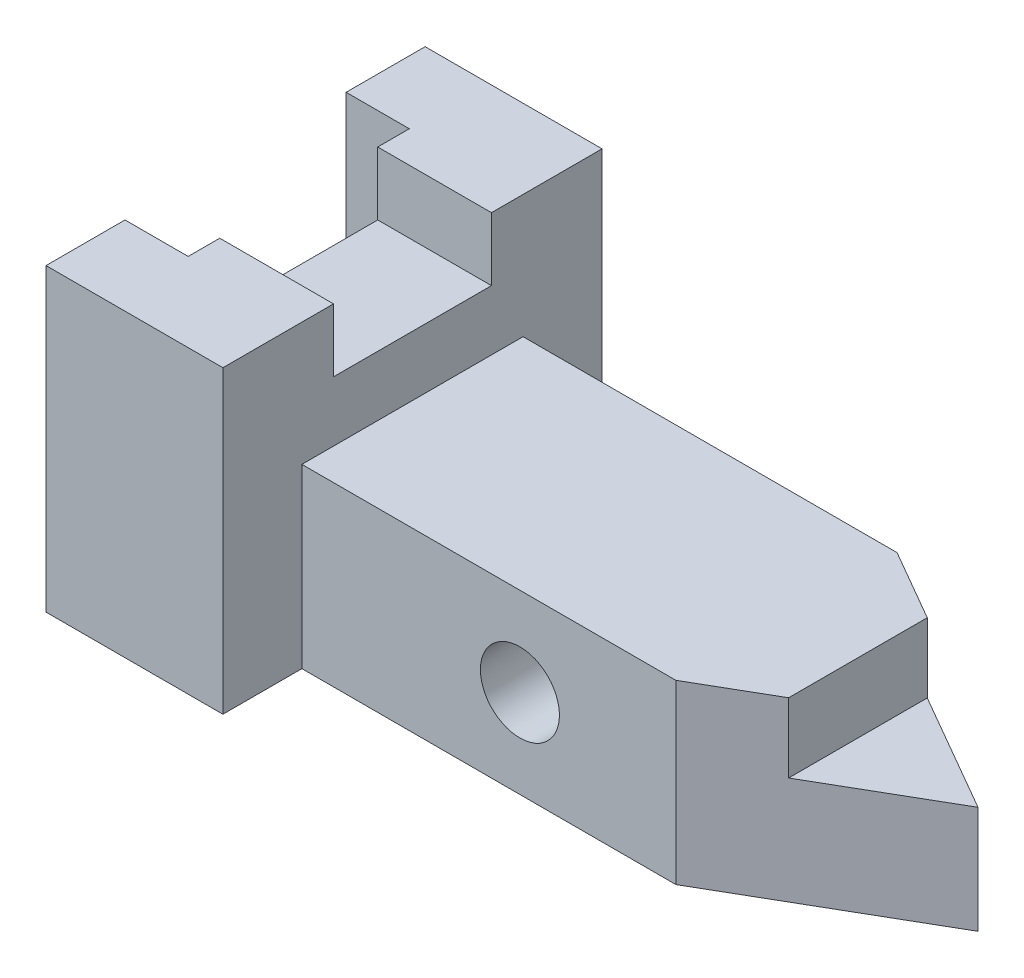
ISO-10303-21;
HEADER;
FILE_DESCRIPTION(('STEP AP214'),'2;1');
FILE_NAME('part.step','',(''),(''),'','','');
FILE_SCHEMA(('AUTOMOTIVE_DESIGN { 1 0 10303 214 1 1 1 1 }'));
ENDSEC;
DATA;
#1=APPLICATION_CONTEXT('core data for automotive mechanical design processes');
#2=APPLICATION_PROTOCOL_DEFINITION('international standard','automotive_design',2000,#1);
#3=PRODUCT_CONTEXT('',#1,'mechanical');
#4=PRODUCT('Part','Part','',(#3));
#5=PRODUCT_RELATED_PRODUCT_CATEGORY('part','',(#4));
#6=PRODUCT_DEFINITION_FORMATION('','',#4);
#7=PRODUCT_DEFINITION_CONTEXT('part definition',#1,'design');
#8=PRODUCT_DEFINITION('design','',#6,#7);
#9=PRODUCT_DEFINITION_SHAPE('','',#8);
#10=(LENGTH_UNIT() NAMED_UNIT(*) SI_UNIT(.MILLI.,.METRE.));
#11=(NAMED_UNIT(*) PLANE_ANGLE_UNIT() SI_UNIT($,.RADIAN.));
#12=(NAMED_UNIT(*) SI_UNIT($,.STERADIAN.) SOLID_ANGLE_UNIT());
#13=UNCERTAINTY_MEASURE_WITH_UNIT(LENGTH_MEASURE(1.E-05),#10,'distance_accuracy_value','');
#14=(GEOMETRIC_REPRESENTATION_CONTEXT(3) GLOBAL_UNCERTAINTY_ASSIGNED_CONTEXT((#13)) GLOBAL_UNIT_ASSIGNED_CONTEXT((#10,
#11,#12)) REPRESENTATION_CONTEXT('',''));
#15=CARTESIAN_POINT('',(0.,0.,0.));
#16=DIRECTION('',(0.,0.,1.));
#17=DIRECTION('',(1.,0.,0.));
#18=AXIS2_PLACEMENT_3D('',#15,#16,#17);
#19=CARTESIAN_POINT('',(78.4241366414252,28.448,17.78));
#20=DIRECTION('',(0.,0.,-1.));
#21=DIRECTION('',(-1.,0.,0.));
#22=AXIS2_PLACEMENT_3D('',#19,#20,#21);
#23=PLANE('',#22);
#24=DIRECTION('',(1.,0.,0.));
#25=VECTOR('',#24,1.);
#26=CARTESIAN_POINT('',(78.4241366414252,0.,17.78));
#27=LINE('',#26,#25);
#28=CARTESIAN_POINT('',(18.288,0.,17.78));
#29=VERTEX_POINT('',#28);
#30=CARTESIAN_POINT('',(78.4241366414252,0.,17.78));
#31=VERTEX_POINT('',#30);
#32=EDGE_CURVE('E350',#29,#31,#27,.T.);
#33=ORIENTED_EDGE('',*,*,#32,.T.);
#34=DIRECTION('',(0.,-1.,0.));
#35=VECTOR('',#34,1.);
#36=CARTESIAN_POINT('',(78.4241366414252,28.448,17.78));
#37=LINE('',#36,#35);
#38=CARTESIAN_POINT('',(78.4241366414252,28.448,17.78));
#39=VERTEX_POINT('',#38);
#40=EDGE_CURVE('E202',#39,#31,#37,.T.);
#41=ORIENTED_EDGE('',*,*,#40,.F.);
#42=DIRECTION('',(1.,0.,0.));
#43=VECTOR('',#42,1.);
#44=CARTESIAN_POINT('',(78.4241366414252,28.448,17.78));
#45=LINE('',#44,#43);
#46=CARTESIAN_POINT('',(18.288,28.448,17.78));
#47=VERTEX_POINT('',#46);
#48=EDGE_CURVE('E337',#47,#39,#45,.T.);
#49=ORIENTED_EDGE('',*,*,#48,.F.);
#50=DIRECTION('',(0.,-1.,0.));
#51=VECTOR('',#50,1.);
#52=CARTESIAN_POINT('',(18.288,28.448,17.78));
#53=LINE('',#52,#51);
#54=EDGE_CURVE('E346',#47,#29,#53,.T.);
#55=ORIENTED_EDGE('',*,*,#54,.T.);
#56=EDGE_LOOP('',(#33,#41,#49,#55));
#57=FACE_BOUND('',#56,.T.);
#58=CARTESIAN_POINT('',(53.34,14.224,17.78));
#59=DIRECTION('',(0.,0.,-1.));
#60=DIRECTION('',(-1.,0.,0.));
#61=AXIS2_PLACEMENT_3D('',#58,#59,#60);
#62=CIRCLE('',#61,6.35);
#63=CARTESIAN_POINT('',(46.99,14.224,17.78));
#64=VERTEX_POINT('',#63);
#65=EDGE_CURVE('E378',#64,#64,#62,.T.);
#66=ORIENTED_EDGE('',*,*,#65,.T.);
#67=EDGE_LOOP('',(#66));
#68=FACE_BOUND('',#67,.T.);
#69=ADVANCED_FACE('F46',(#57,#68),#23,.F.);
#70=CARTESIAN_POINT('',(18.288,28.448,-17.78));
#71=DIRECTION('',(0.,0.,1.));
#72=DIRECTION('',(1.,0.,0.));
#73=AXIS2_PLACEMENT_3D('',#70,#71,#72);
#74=PLANE('',#73);
#75=DIRECTION('',(-1.,0.,0.));
#76=VECTOR('',#75,1.);
#77=CARTESIAN_POINT('',(18.288,0.,-17.78));
#78=LINE('',#77,#76);
#79=CARTESIAN_POINT('',(78.4241366414252,0.,-17.78));
#80=VERTEX_POINT('',#79);
#81=CARTESIAN_POINT('',(18.288,0.,-17.78));
#82=VERTEX_POINT('',#81);
#83=EDGE_CURVE('E71',#80,#82,#78,.T.);
#84=ORIENTED_EDGE('',*,*,#83,.T.);
#85=DIRECTION('',(0.,-1.,0.));
#86=VECTOR('',#85,1.);
#87=CARTESIAN_POINT('',(18.288,28.448,-17.78));
#88=LINE('',#87,#86);
#89=CARTESIAN_POINT('',(18.288,28.448,-17.78));
#90=VERTEX_POINT('',#89);
#91=EDGE_CURVE('E207',#90,#82,#88,.T.);
#92=ORIENTED_EDGE('',*,*,#91,.F.);
#93=DIRECTION('',(-1.,0.,0.));
#94=VECTOR('',#93,1.);
#95=CARTESIAN_POINT('',(18.288,28.448,-17.78));
#96=LINE('',#95,#94);
#97=CARTESIAN_POINT('',(78.4241366414252,28.448,-17.78));
#98=VERTEX_POINT('',#97);
#99=EDGE_CURVE('E366',#98,#90,#96,.T.);
#100=ORIENTED_EDGE('',*,*,#99,.F.);
#101=DIRECTION('',(0.,-1.,0.));
#102=VECTOR('',#101,1.);
#103=CARTESIAN_POINT('',(78.4241366414252,28.448,-17.78));
#104=LINE('',#103,#102);
#105=EDGE_CURVE('E203',#98,#80,#104,.T.);
#106=ORIENTED_EDGE('',*,*,#105,.T.);
#107=EDGE_LOOP('',(#84,#92,#100,#106));
#108=FACE_BOUND('',#107,.T.);
#109=CARTESIAN_POINT('',(53.34,14.224,-17.78));
#110=DIRECTION('',(0.,0.,1.));
#111=DIRECTION('',(1.,0.,0.));
#112=AXIS2_PLACEMENT_3D('',#109,#110,#111);
#113=CIRCLE('',#112,6.35);
#114=CARTESIAN_POINT('',(59.69,14.224,-17.78));
#115=VERTEX_POINT('',#114);
#116=EDGE_CURVE('E385',#115,#115,#113,.F.);
#117=ORIENTED_EDGE('',*,*,#116,.F.);
#118=EDGE_LOOP('',(#117));
#119=FACE_BOUND('',#118,.T.);
#120=ADVANCED_FACE('F379',(#108,#119),#74,.F.);
#121=CARTESIAN_POINT('',(18.288,48.26,30.48));
#122=DIRECTION('',(-1.,0.,0.));
#123=DIRECTION('',(0.,0.,1.));
#124=AXIS2_PLACEMENT_3D('',#121,#122,#123);
#125=PLANE('',#124);
#126=ORIENTED_EDGE('',*,*,#54,.F.);
#127=DIRECTION('',(0.,0.,1.));
#128=VECTOR('',#127,1.);
#129=CARTESIAN_POINT('',(18.288,28.448,17.78));
#130=LINE('',#129,#128);
#131=EDGE_CURVE('E348',#90,#47,#130,.T.);
#132=ORIENTED_EDGE('',*,*,#131,.F.);
#133=ORIENTED_EDGE('',*,*,#91,.T.);
#134=DIRECTION('',(0.,0.,-1.));
#135=VECTOR('',#134,1.);
#136=CARTESIAN_POINT('',(18.288,0.,30.48));
#137=LINE('',#136,#135);
#138=CARTESIAN_POINT('',(18.288,0.,-30.48));
#139=VERTEX_POINT('',#138);
#140=EDGE_CURVE('E256',#82,#139,#137,.T.);
#141=ORIENTED_EDGE('',*,*,#140,.T.);
#142=DIRECTION('',(0.,-1.,0.));
#143=VECTOR('',#142,1.);
#144=CARTESIAN_POINT('',(18.288,48.26,-30.48));
#145=LINE('',#144,#143);
#146=CARTESIAN_POINT('',(18.288,48.26,-30.48));
#147=VERTEX_POINT('',#146);
#148=EDGE_CURVE('E279',#147,#139,#145,.T.);
#149=ORIENTED_EDGE('',*,*,#148,.F.);
#150=DIRECTION('',(0.,0.,-1.));
#151=VECTOR('',#150,1.);
#152=CARTESIAN_POINT('',(18.288,48.26,30.48));
#153=LINE('',#152,#151);
#154=CARTESIAN_POINT('',(18.288,48.26,-12.7));
#155=VERTEX_POINT('',#154);
#156=EDGE_CURVE('E235',#155,#147,#153,.T.);
#157=ORIENTED_EDGE('',*,*,#156,.F.);
#158=DIRECTION('',(0.,1.,0.));
#159=VECTOR('',#158,1.);
#160=CARTESIAN_POINT('',(18.288,48.26,-12.7));
#161=LINE('',#160,#159);
#162=CARTESIAN_POINT('',(18.288,38.1,-12.7));
#163=VERTEX_POINT('',#162);
#164=EDGE_CURVE('E216',#163,#155,#161,.T.);
#165=ORIENTED_EDGE('',*,*,#164,.F.);
#166=DIRECTION('',(0.,0.,-1.));
#167=VECTOR('',#166,1.);
#168=CARTESIAN_POINT('',(18.288,38.1,12.7));
#169=LINE('',#168,#167);
#170=CARTESIAN_POINT('',(18.288,38.1,12.7));
#171=VERTEX_POINT('',#170);
#172=EDGE_CURVE('E213',#171,#163,#169,.T.);
#173=ORIENTED_EDGE('',*,*,#172,.F.);
#174=DIRECTION('',(0.,-1.,0.));
#175=VECTOR('',#174,1.);
#176=CARTESIAN_POINT('',(18.288,48.26,12.7));
#177=LINE('',#176,#175);
#178=CARTESIAN_POINT('',(18.288,48.26,12.7));
#179=VERTEX_POINT('',#178);
#180=EDGE_CURVE('E205',#179,#171,#177,.T.);
#181=ORIENTED_EDGE('',*,*,#180,.F.);
#182=CARTESIAN_POINT('',(18.288,48.26,30.48));
#183=VERTEX_POINT('',#182);
#184=EDGE_CURVE('E236',#183,#179,#153,.T.);
#185=ORIENTED_EDGE('',*,*,#184,.F.);
#186=DIRECTION('',(0.,-1.,0.));
#187=VECTOR('',#186,1.);
#188=CARTESIAN_POINT('',(18.288,48.26,30.48));
#189=LINE('',#188,#187);
#190=CARTESIAN_POINT('',(18.288,0.,30.48));
#191=VERTEX_POINT('',#190);
#192=EDGE_CURVE('E276',#183,#191,#189,.T.);
#193=ORIENTED_EDGE('',*,*,#192,.T.);
#194=EDGE_CURVE('E265',#191,#29,#137,.T.);
#195=ORIENTED_EDGE('',*,*,#194,.T.);
#196=EDGE_LOOP('',(#126,#132,#133,#141,#149,#157,#165,#173,#181,#185,#193,#195));
#197=FACE_BOUND('',#196,.T.);
#198=ADVANCED_FACE('F334',(#197),#125,.F.);
#199=CARTESIAN_POINT('',(-10.16,48.26,17.78));
#200=DIRECTION('',(0.,-1.,0.));
#201=DIRECTION('',(0.,0.,-1.));
#202=AXIS2_PLACEMENT_3D('',#199,#200,#201);
#203=PLANE('',#202);
#204=ORIENTED_EDGE('',*,*,#184,.T.);
#205=DIRECTION('',(-1.,0.,0.));
#206=VECTOR('',#205,1.);
#207=CARTESIAN_POINT('',(-10.16,48.26,12.7));
#208=LINE('',#207,#206);
#209=CARTESIAN_POINT('',(0.,48.26,12.7));
#210=VERTEX_POINT('',#209);
#211=EDGE_CURVE('E55',#179,#210,#208,.T.);
#212=ORIENTED_EDGE('',*,*,#211,.T.);
#213=DIRECTION('',(0.,0.,1.));
#214=VECTOR('',#213,1.);
#215=CARTESIAN_POINT('',(0.,48.26,17.78));
#216=LINE('',#215,#214);
#217=CARTESIAN_POINT('',(0.,48.26,17.78));
#218=VERTEX_POINT('',#217);
#219=EDGE_CURVE('E245',#210,#218,#216,.T.);
#220=ORIENTED_EDGE('',*,*,#219,.T.);
#221=DIRECTION('',(-1.,0.,0.));
#222=VECTOR('',#221,1.);
#223=CARTESIAN_POINT('',(-10.16,48.26,17.78));
#224=LINE('',#223,#222);
#225=CARTESIAN_POINT('',(-10.16,48.26,17.78));
#226=VERTEX_POINT('',#225);
#227=EDGE_CURVE('E249',#218,#226,#224,.T.);
#228=ORIENTED_EDGE('',*,*,#227,.T.);
#229=DIRECTION('',(0.,0.,1.));
#230=VECTOR('',#229,1.);
#231=CARTESIAN_POINT('',(-10.16,48.26,30.48));
#232=LINE('',#231,#230);
#233=CARTESIAN_POINT('',(-10.16,48.26,30.48));
#234=VERTEX_POINT('',#233);
#235=EDGE_CURVE('E229',#226,#234,#232,.T.);
#236=ORIENTED_EDGE('',*,*,#235,.T.);
#237=DIRECTION('',(1.,0.,0.));
#238=VECTOR('',#237,1.);
#239=CARTESIAN_POINT('',(-10.16,48.26,30.48));
#240=LINE('',#239,#238);
#241=EDGE_CURVE('E232',#234,#183,#240,.T.);
#242=ORIENTED_EDGE('',*,*,#241,.T.);
#243=EDGE_LOOP('',(#204,#212,#220,#228,#236,#242));
#244=FACE_BOUND('',#243,.T.);
#245=ADVANCED_FACE('F422',(#244),#203,.F.);
#246=CARTESIAN_POINT('',(-10.16,48.26,30.48));
#247=DIRECTION('',(1.,0.,0.));
#248=DIRECTION('',(0.,0.,-1.));
#249=AXIS2_PLACEMENT_3D('',#246,#247,#248);
#250=PLANE('',#249);
#251=DIRECTION('',(0.,0.,1.));
#252=VECTOR('',#251,1.);
#253=CARTESIAN_POINT('',(-10.16,0.,30.48));
#254=LINE('',#253,#252);
#255=CARTESIAN_POINT('',(-10.16,0.,17.78));
#256=VERTEX_POINT('',#255);
#257=CARTESIAN_POINT('',(-10.16,0.,30.48));
#258=VERTEX_POINT('',#257);
#259=EDGE_CURVE('E228',#256,#258,#254,.T.);
#260=ORIENTED_EDGE('',*,*,#259,.T.);
#261=DIRECTION('',(0.,-1.,0.));
#262=VECTOR('',#261,1.);
#263=CARTESIAN_POINT('',(-10.16,48.26,30.48));
#264=LINE('',#263,#262);
#265=EDGE_CURVE('E273',#234,#258,#264,.T.);
#266=ORIENTED_EDGE('',*,*,#265,.F.);
#267=ORIENTED_EDGE('',*,*,#235,.F.);
#268=DIRECTION('',(0.,-1.,0.));
#269=VECTOR('',#268,1.);
#270=CARTESIAN_POINT('',(-10.16,48.26,17.78));
#271=LINE('',#270,#269);
#272=EDGE_CURVE('E251',#226,#256,#271,.T.);
#273=ORIENTED_EDGE('',*,*,#272,.T.);
#274=EDGE_LOOP('',(#260,#266,#267,#273));
#275=FACE_BOUND('',#274,.T.);
#276=ADVANCED_FACE('F48',(#275),#250,.F.);
#277=CARTESIAN_POINT('',(-10.16,48.26,30.48));
#278=DIRECTION('',(0.,0.,-1.));
#279=DIRECTION('',(-1.,0.,0.));
#280=AXIS2_PLACEMENT_3D('',#277,#278,#279);
#281=PLANE('',#280);
#282=DIRECTION('',(1.,0.,0.));
#283=VECTOR('',#282,1.);
#284=CARTESIAN_POINT('',(-10.16,0.,30.48));
#285=LINE('',#284,#283);
#286=EDGE_CURVE('E254',#258,#191,#285,.T.);
#287=ORIENTED_EDGE('',*,*,#286,.T.);
#288=ORIENTED_EDGE('',*,*,#192,.F.);
#289=ORIENTED_EDGE('',*,*,#241,.F.);
#290=ORIENTED_EDGE('',*,*,#265,.T.);
#291=EDGE_LOOP('',(#287,#288,#289,#290));
#292=FACE_BOUND('',#291,.T.);
#293=ADVANCED_FACE('F436',(#292),#281,.F.);
#294=CARTESIAN_POINT('',(-10.16,48.26,-30.48));
#295=DIRECTION('',(0.,0.,1.));
#296=DIRECTION('',(1.,0.,0.));
#297=AXIS2_PLACEMENT_3D('',#294,#295,#296);
#298=PLANE('',#297);
#299=DIRECTION('',(-1.,0.,0.));
#300=VECTOR('',#299,1.);
#301=CARTESIAN_POINT('',(-10.16,0.,-30.48));
#302=LINE('',#301,#300);
#303=CARTESIAN_POINT('',(-10.16,0.,-30.48));
#304=VERTEX_POINT('',#303);
#305=EDGE_CURVE('E259',#139,#304,#302,.T.);
#306=ORIENTED_EDGE('',*,*,#305,.T.);
#307=DIRECTION('',(0.,-1.,0.));
#308=VECTOR('',#307,1.);
#309=CARTESIAN_POINT('',(-10.16,48.26,-30.48));
#310=LINE('',#309,#308);
#311=CARTESIAN_POINT('',(-10.16,48.26,-30.48));
#312=VERTEX_POINT('',#311);
#313=EDGE_CURVE('E282',#312,#304,#310,.T.);
#314=ORIENTED_EDGE('',*,*,#313,.F.);
#315=DIRECTION('',(-1.,0.,0.));
#316=VECTOR('',#315,1.);
#317=CARTESIAN_POINT('',(-10.16,48.26,-30.48));
#318=LINE('',#317,#316);
#319=EDGE_CURVE('E239',#147,#312,#318,.T.);
#320=ORIENTED_EDGE('',*,*,#319,.F.);
#321=ORIENTED_EDGE('',*,*,#148,.T.);
#322=EDGE_LOOP('',(#306,#314,#320,#321));
#323=FACE_BOUND('',#322,.T.);
#324=ADVANCED_FACE('F307',(#323),#298,.F.);
#325=CARTESIAN_POINT('',(-10.16,48.26,-17.78));
#326=DIRECTION('',(1.,0.,0.));
#327=DIRECTION('',(0.,0.,-1.));
#328=AXIS2_PLACEMENT_3D('',#325,#326,#327);
#329=PLANE('',#328);
#330=DIRECTION('',(0.,0.,1.));
#331=VECTOR('',#330,1.);
#332=CARTESIAN_POINT('',(-10.16,0.,-17.78));
#333=LINE('',#332,#331);
#334=CARTESIAN_POINT('',(-10.16,0.,-17.78));
#335=VERTEX_POINT('',#334);
#336=EDGE_CURVE('E300',#304,#335,#333,.T.);
#337=ORIENTED_EDGE('',*,*,#336,.T.);
#338=DIRECTION('',(0.,-1.,0.));
#339=VECTOR('',#338,1.);
#340=CARTESIAN_POINT('',(-10.16,48.26,-17.78));
#341=LINE('',#340,#339);
#342=CARTESIAN_POINT('',(-10.16,48.26,-17.78));
#343=VERTEX_POINT('',#342);
#344=EDGE_CURVE('E285',#343,#335,#341,.T.);
#345=ORIENTED_EDGE('',*,*,#344,.F.);
#346=DIRECTION('',(0.,0.,1.));
#347=VECTOR('',#346,1.);
#348=CARTESIAN_POINT('',(-10.16,48.26,-17.78));
#349=LINE('',#348,#347);
#350=EDGE_CURVE('E241',#312,#343,#349,.T.);
#351=ORIENTED_EDGE('',*,*,#350,.F.);
#352=ORIENTED_EDGE('',*,*,#313,.T.);
#353=EDGE_LOOP('',(#337,#345,#351,#352));
#354=FACE_BOUND('',#353,.T.);
#355=ADVANCED_FACE('F313',(#354),#329,.F.);
#356=CARTESIAN_POINT('',(0.,48.26,-17.78));
#357=DIRECTION('',(0.,0.,-1.));
#358=DIRECTION('',(-1.,0.,0.));
#359=AXIS2_PLACEMENT_3D('',#356,#357,#358);
#360=PLANE('',#359);
#361=DIRECTION('',(1.,0.,0.));
#362=VECTOR('',#361,1.);
#363=CARTESIAN_POINT('',(0.,0.,-17.78));
#364=LINE('',#363,#362);
#365=CARTESIAN_POINT('',(0.,0.,-17.78));
#366=VERTEX_POINT('',#365);
#367=EDGE_CURVE('E299',#335,#366,#364,.T.);
#368=ORIENTED_EDGE('',*,*,#367,.T.);
#369=DIRECTION('',(0.,-1.,0.));
#370=VECTOR('',#369,1.);
#371=CARTESIAN_POINT('',(0.,48.26,-17.78));
#372=LINE('',#371,#370);
#373=CARTESIAN_POINT('',(0.,48.26,-17.78));
#374=VERTEX_POINT('',#373);
#375=EDGE_CURVE('E288',#374,#366,#372,.T.);
#376=ORIENTED_EDGE('',*,*,#375,.F.);
#377=DIRECTION('',(1.,0.,0.));
#378=VECTOR('',#377,1.);
#379=CARTESIAN_POINT('',(0.,48.26,-17.78));
#380=LINE('',#379,#378);
#381=EDGE_CURVE('E243',#343,#374,#380,.T.);
#382=ORIENTED_EDGE('',*,*,#381,.F.);
#383=ORIENTED_EDGE('',*,*,#344,.T.);
#384=EDGE_LOOP('',(#368,#376,#382,#383));
#385=FACE_BOUND('',#384,.T.);
#386=ADVANCED_FACE('F321',(#385),#360,.F.);
#387=CARTESIAN_POINT('',(0.,48.26,17.78));
#388=DIRECTION('',(1.,0.,0.));
#389=DIRECTION('',(0.,0.,-1.));
#390=AXIS2_PLACEMENT_3D('',#387,#388,#389);
#391=PLANE('',#390);
#392=ORIENTED_EDGE('',*,*,#219,.F.);
#393=DIRECTION('',(0.,-1.,0.));
#394=VECTOR('',#393,1.);
#395=CARTESIAN_POINT('',(0.,48.26,12.7));
#396=LINE('',#395,#394);
#397=CARTESIAN_POINT('',(0.,38.1,12.7));
#398=VERTEX_POINT('',#397);
#399=EDGE_CURVE('E225',#210,#398,#396,.T.);
#400=ORIENTED_EDGE('',*,*,#399,.T.);
#401=DIRECTION('',(0.,0.,-1.));
#402=VECTOR('',#401,1.);
#403=CARTESIAN_POINT('',(0.,38.1,17.78));
#404=LINE('',#403,#402);
#405=CARTESIAN_POINT('',(0.,38.1,-12.7));
#406=VERTEX_POINT('',#405);
#407=EDGE_CURVE('E13',#398,#406,#404,.T.);
#408=ORIENTED_EDGE('',*,*,#407,.T.);
#409=DIRECTION('',(0.,1.,0.));
#410=VECTOR('',#409,1.);
#411=CARTESIAN_POINT('',(0.,48.26,-12.7));
#412=LINE('',#411,#410);
#413=CARTESIAN_POINT('',(0.,48.26,-12.7));
#414=VERTEX_POINT('',#413);
#415=EDGE_CURVE('E221',#406,#414,#412,.T.);
#416=ORIENTED_EDGE('',*,*,#415,.T.);
#417=EDGE_CURVE('E246',#374,#414,#216,.T.);
#418=ORIENTED_EDGE('',*,*,#417,.F.);
#419=ORIENTED_EDGE('',*,*,#375,.T.);
#420=DIRECTION('',(0.,0.,1.));
#421=VECTOR('',#420,1.);
#422=CARTESIAN_POINT('',(0.,0.,17.78));
#423=LINE('',#422,#421);
#424=CARTESIAN_POINT('',(0.,0.,17.78));
#425=VERTEX_POINT('',#424);
#426=EDGE_CURVE('E297',#366,#425,#423,.T.);
#427=ORIENTED_EDGE('',*,*,#426,.T.);
#428=DIRECTION('',(0.,-1.,0.));
#429=VECTOR('',#428,1.);
#430=CARTESIAN_POINT('',(0.,48.26,17.78));
#431=LINE('',#430,#429);
#432=EDGE_CURVE('E291',#218,#425,#431,.T.);
#433=ORIENTED_EDGE('',*,*,#432,.F.);
#434=EDGE_LOOP('',(#392,#400,#408,#416,#418,#419,#427,#433));
#435=FACE_BOUND('',#434,.T.);
#436=ADVANCED_FACE('F326',(#435),#391,.F.);
#437=CARTESIAN_POINT('',(-10.16,48.26,17.78));
#438=DIRECTION('',(0.,0.,1.));
#439=DIRECTION('',(1.,0.,0.));
#440=AXIS2_PLACEMENT_3D('',#437,#438,#439);
#441=PLANE('',#440);
#442=DIRECTION('',(-1.,0.,0.));
#443=VECTOR('',#442,1.);
#444=CARTESIAN_POINT('',(-10.16,0.,17.78));
#445=LINE('',#444,#443);
#446=EDGE_CURVE('E233',#425,#256,#445,.T.);
#447=ORIENTED_EDGE('',*,*,#446,.T.);
#448=ORIENTED_EDGE('',*,*,#272,.F.);
#449=ORIENTED_EDGE('',*,*,#227,.F.);
#450=ORIENTED_EDGE('',*,*,#432,.T.);
#451=EDGE_LOOP('',(#447,#448,#449,#450));
#452=FACE_BOUND('',#451,.T.);
#453=ADVANCED_FACE('F421',(#452),#441,.F.);
#454=ORIENTED_EDGE('',*,*,#417,.T.);
#455=DIRECTION('',(1.,0.,0.));
#456=VECTOR('',#455,1.);
#457=CARTESIAN_POINT('',(-10.16,48.26,-12.7));
#458=LINE('',#457,#456);
#459=EDGE_CURVE('E270',#414,#155,#458,.T.);
#460=ORIENTED_EDGE('',*,*,#459,.T.);
#461=ORIENTED_EDGE('',*,*,#156,.T.);
#462=ORIENTED_EDGE('',*,*,#319,.T.);
#463=ORIENTED_EDGE('',*,*,#350,.T.);
#464=ORIENTED_EDGE('',*,*,#381,.T.);
#465=EDGE_LOOP('',(#454,#460,#461,#462,#463,#464));
#466=FACE_BOUND('',#465,.T.);
#467=ADVANCED_FACE('F329',(#466),#203,.F.);
#468=CARTESIAN_POINT('',(-10.16,0.,17.78));
#469=DIRECTION('',(0.,-1.,0.));
#470=DIRECTION('',(0.,0.,-1.));
#471=AXIS2_PLACEMENT_3D('',#468,#469,#470);
#472=PLANE('',#471);
#473=ORIENTED_EDGE('',*,*,#259,.F.);
#474=ORIENTED_EDGE('',*,*,#446,.F.);
#475=ORIENTED_EDGE('',*,*,#426,.F.);
#476=ORIENTED_EDGE('',*,*,#367,.F.);
#477=ORIENTED_EDGE('',*,*,#336,.F.);
#478=ORIENTED_EDGE('',*,*,#305,.F.);
#479=ORIENTED_EDGE('',*,*,#140,.F.);
#480=ORIENTED_EDGE('',*,*,#83,.F.);
#481=DIRECTION('',(-0.86602540378444,0.,-0.499999999999998));
#482=VECTOR('',#481,1.);
#483=CARTESIAN_POINT('',(78.4241366414252,0.,-17.78));
#484=LINE('',#483,#482);
#485=CARTESIAN_POINT('',(109.22,0.,0.));
#486=VERTEX_POINT('',#485);
#487=EDGE_CURVE('E336',#486,#80,#484,.T.);
#488=ORIENTED_EDGE('',*,*,#487,.F.);
#489=DIRECTION('',(0.86602540378444,0.,-0.499999999999998));
#490=VECTOR('',#489,1.);
#491=CARTESIAN_POINT('',(109.22,0.,0.));
#492=LINE('',#491,#490);
#493=EDGE_CURVE('E200',#31,#486,#492,.T.);
#494=ORIENTED_EDGE('',*,*,#493,.F.);
#495=ORIENTED_EDGE('',*,*,#32,.F.);
#496=ORIENTED_EDGE('',*,*,#194,.F.);
#497=ORIENTED_EDGE('',*,*,#286,.F.);
#498=EDGE_LOOP('',(#473,#474,#475,#476,#477,#478,#479,#480,#488,#494,#495,#496,#497));
#499=FACE_BOUND('',#498,.T.);
#500=ADVANCED_FACE('F316',(#499),#472,.T.);
#501=CARTESIAN_POINT('',(-10.16,38.1,12.7));
#502=DIRECTION('',(0.,-1.,0.));
#503=DIRECTION('',(0.,0.,-1.));
#504=AXIS2_PLACEMENT_3D('',#501,#502,#503);
#505=PLANE('',#504);
#506=DIRECTION('',(1.,0.,0.));
#507=VECTOR('',#506,1.);
#508=CARTESIAN_POINT('',(-10.16,38.1,12.7));
#509=LINE('',#508,#507);
#510=EDGE_CURVE('E218',#398,#171,#509,.T.);
#511=ORIENTED_EDGE('',*,*,#510,.T.);
#512=ORIENTED_EDGE('',*,*,#172,.T.);
#513=DIRECTION('',(1.,0.,0.));
#514=VECTOR('',#513,1.);
#515=CARTESIAN_POINT('',(-10.16,38.1,-12.7));
#516=LINE('',#515,#514);
#517=EDGE_CURVE('E219',#406,#163,#516,.T.);
#518=ORIENTED_EDGE('',*,*,#517,.F.);
#519=ORIENTED_EDGE('',*,*,#407,.F.);
#520=EDGE_LOOP('',(#511,#512,#518,#519));
#521=FACE_BOUND('',#520,.T.);
#522=ADVANCED_FACE('F412',(#521),#505,.F.);
#523=CARTESIAN_POINT('',(-10.16,48.26,12.7));
#524=DIRECTION('',(0.,0.,1.));
#525=DIRECTION('',(0.,-1.,0.));
#526=AXIS2_PLACEMENT_3D('',#523,#524,#525);
#527=PLANE('',#526);
#528=ORIENTED_EDGE('',*,*,#211,.F.);
#529=ORIENTED_EDGE('',*,*,#180,.T.);
#530=ORIENTED_EDGE('',*,*,#510,.F.);
#531=ORIENTED_EDGE('',*,*,#399,.F.);
#532=EDGE_LOOP('',(#528,#529,#530,#531));
#533=FACE_BOUND('',#532,.T.);
#534=ADVANCED_FACE('F410',(#533),#527,.F.);
#535=CARTESIAN_POINT('',(-10.16,48.26,-12.7));
#536=DIRECTION('',(0.,0.,-1.));
#537=DIRECTION('',(0.,1.,0.));
#538=AXIS2_PLACEMENT_3D('',#535,#536,#537);
#539=PLANE('',#538);
#540=ORIENTED_EDGE('',*,*,#517,.T.);
#541=ORIENTED_EDGE('',*,*,#164,.T.);
#542=ORIENTED_EDGE('',*,*,#459,.F.);
#543=ORIENTED_EDGE('',*,*,#415,.F.);
#544=EDGE_LOOP('',(#540,#541,#542,#543));
#545=FACE_BOUND('',#544,.T.);
#546=ADVANCED_FACE('F407',(#545),#539,.F.);
#547=CARTESIAN_POINT('',(109.22,28.448,0.));
#548=DIRECTION('',(-0.499999999999998,0.,-0.86602540378444));
#549=DIRECTION('',(-0.86602540378444,0.,0.499999999999998));
#550=AXIS2_PLACEMENT_3D('',#547,#548,#549);
#551=PLANE('',#550);
#552=DIRECTION('',(0.866025403784441,0.,-0.499999999999997));
#553=VECTOR('',#552,1.);
#554=CARTESIAN_POINT('',(89.916,17.272,11.1451695964364));
#555=LINE('',#554,#553);
#556=CARTESIAN_POINT('',(89.916,17.272,11.1451695964364));
#557=VERTEX_POINT('',#556);
#558=CARTESIAN_POINT('',(109.22,17.272,0.));
#559=VERTEX_POINT('',#558);
#560=EDGE_CURVE('E182',#557,#559,#555,.T.);
#561=ORIENTED_EDGE('',*,*,#560,.F.);
#562=DIRECTION('',(0.,1.,0.));
#563=VECTOR('',#562,1.);
#564=CARTESIAN_POINT('',(89.916,17.272,11.1451695964364));
#565=LINE('',#564,#563);
#566=CARTESIAN_POINT('',(89.916,28.448,11.1451695964364));
#567=VERTEX_POINT('',#566);
#568=EDGE_CURVE('E352',#557,#567,#565,.T.);
#569=ORIENTED_EDGE('',*,*,#568,.T.);
#570=DIRECTION('',(0.86602540378444,0.,-0.499999999999998));
#571=VECTOR('',#570,1.);
#572=CARTESIAN_POINT('',(109.22,28.448,0.));
#573=LINE('',#572,#571);
#574=EDGE_CURVE('E340',#39,#567,#573,.T.);
#575=ORIENTED_EDGE('',*,*,#574,.F.);
#576=ORIENTED_EDGE('',*,*,#40,.T.);
#577=ORIENTED_EDGE('',*,*,#493,.T.);
#578=DIRECTION('',(0.,-1.,0.));
#579=VECTOR('',#578,1.);
#580=CARTESIAN_POINT('',(109.22,28.448,0.));
#581=LINE('',#580,#579);
#582=EDGE_CURVE('E195',#559,#486,#581,.T.);
#583=ORIENTED_EDGE('',*,*,#582,.F.);
#584=EDGE_LOOP('',(#561,#569,#575,#576,#577,#583));
#585=FACE_BOUND('',#584,.T.);
#586=ADVANCED_FACE('F198',(#585),#551,.F.);
#587=CARTESIAN_POINT('',(78.4241366414252,28.448,-17.78));
#588=DIRECTION('',(-0.499999999999998,0.,0.86602540378444));
#589=DIRECTION('',(0.86602540378444,0.,0.499999999999998));
#590=AXIS2_PLACEMENT_3D('',#587,#588,#589);
#591=PLANE('',#590);
#592=DIRECTION('',(-0.86602540378444,0.,-0.499999999999998));
#593=VECTOR('',#592,1.);
#594=CARTESIAN_POINT('',(78.4241366414252,28.448,-17.78));
#595=LINE('',#594,#593);
#596=CARTESIAN_POINT('',(89.916,28.448,-11.1451695964365));
#597=VERTEX_POINT('',#596);
#598=EDGE_CURVE('E364',#597,#98,#595,.T.);
#599=ORIENTED_EDGE('',*,*,#598,.F.);
#600=DIRECTION('',(0.,1.,0.));
#601=VECTOR('',#600,1.);
#602=CARTESIAN_POINT('',(89.916,17.272,-11.1451695964365));
#603=LINE('',#602,#601);
#604=CARTESIAN_POINT('',(89.916,17.272,-11.1451695964365));
#605=VERTEX_POINT('',#604);
#606=EDGE_CURVE('E63',#605,#597,#603,.T.);
#607=ORIENTED_EDGE('',*,*,#606,.F.);
#608=DIRECTION('',(-0.866025403784439,0.,-0.5));
#609=VECTOR('',#608,1.);
#610=CARTESIAN_POINT('',(109.22,17.272,0.));
#611=LINE('',#610,#609);
#612=EDGE_CURVE('E185',#559,#605,#611,.T.);
#613=ORIENTED_EDGE('',*,*,#612,.F.);
#614=ORIENTED_EDGE('',*,*,#582,.T.);
#615=ORIENTED_EDGE('',*,*,#487,.T.);
#616=ORIENTED_EDGE('',*,*,#105,.F.);
#617=EDGE_LOOP('',(#599,#607,#613,#614,#615,#616));
#618=FACE_BOUND('',#617,.T.);
#619=ADVANCED_FACE('F194',(#618),#591,.F.);
#620=CARTESIAN_POINT('',(18.288,28.448,17.78));
#621=DIRECTION('',(0.,-1.,0.));
#622=DIRECTION('',(0.,0.,-1.));
#623=AXIS2_PLACEMENT_3D('',#620,#621,#622);
#624=PLANE('',#623);
#625=ORIENTED_EDGE('',*,*,#574,.T.);
#626=DIRECTION('',(0.,0.,1.));
#627=VECTOR('',#626,1.);
#628=CARTESIAN_POINT('',(89.916,28.448,-11.1451695964365));
#629=LINE('',#628,#627);
#630=EDGE_CURVE('E190',#597,#567,#629,.T.);
#631=ORIENTED_EDGE('',*,*,#630,.F.);
#632=ORIENTED_EDGE('',*,*,#598,.T.);
#633=ORIENTED_EDGE('',*,*,#99,.T.);
#634=ORIENTED_EDGE('',*,*,#131,.T.);
#635=ORIENTED_EDGE('',*,*,#48,.T.);
#636=EDGE_LOOP('',(#625,#631,#632,#633,#634,#635));
#637=FACE_BOUND('',#636,.T.);
#638=ADVANCED_FACE('F371',(#637),#624,.F.);
#639=CARTESIAN_POINT('',(89.916,17.272,-11.1451695964365));
#640=DIRECTION('',(-1.,0.,0.));
#641=DIRECTION('',(0.,0.,1.));
#642=AXIS2_PLACEMENT_3D('',#639,#640,#641);
#643=PLANE('',#642);
#644=ORIENTED_EDGE('',*,*,#630,.T.);
#645=ORIENTED_EDGE('',*,*,#568,.F.);
#646=DIRECTION('',(0.,0.,1.));
#647=VECTOR('',#646,1.);
#648=CARTESIAN_POINT('',(89.916,17.272,-11.1451695964365));
#649=LINE('',#648,#647);
#650=EDGE_CURVE('E186',#605,#557,#649,.T.);
#651=ORIENTED_EDGE('',*,*,#650,.F.);
#652=ORIENTED_EDGE('',*,*,#606,.T.);
#653=EDGE_LOOP('',(#644,#645,#651,#652));
#654=FACE_BOUND('',#653,.T.);
#655=ADVANCED_FACE('F398',(#654),#643,.F.);
#656=CARTESIAN_POINT('',(109.22,17.272,0.));
#657=DIRECTION('',(0.,1.,0.));
#658=DIRECTION('',(0.,0.,1.));
#659=AXIS2_PLACEMENT_3D('',#656,#657,#658);
#660=PLANE('',#659);
#661=ORIENTED_EDGE('',*,*,#560,.T.);
#662=ORIENTED_EDGE('',*,*,#612,.T.);
#663=ORIENTED_EDGE('',*,*,#650,.T.);
#664=EDGE_LOOP('',(#661,#662,#663));
#665=FACE_BOUND('',#664,.T.);
#666=ADVANCED_FACE('F184',(#665),#660,.T.);
#667=CARTESIAN_POINT('',(53.34,14.224,30.481025));
#668=DIRECTION('',(0.,0.,-1.));
#669=DIRECTION('',(-1.,0.,0.));
#670=AXIS2_PLACEMENT_3D('',#667,#668,#669);
#671=CYLINDRICAL_SURFACE('',#670,6.35);
#672=ORIENTED_EDGE('',*,*,#65,.F.);
#673=EDGE_LOOP('',(#672));
#674=FACE_BOUND('',#673,.T.);
#675=ORIENTED_EDGE('',*,*,#116,.T.);
#676=EDGE_LOOP('',(#675));
#677=FACE_BOUND('',#676,.T.);
#678=ADVANCED_FACE('F392',(#674,#677),#671,.F.);
#679=CLOSED_SHELL('',(#69,#120,#198,#245,#276,#293,#324,#355,#386,#436,#453,#467,#500,#522,#534,
#546,#586,#619,#638,#655,#666,#678));
#680=MANIFOLD_SOLID_BREP('B2',#679);
#681=ADVANCED_BREP_SHAPE_REPRESENTATION('',(#18,#680),#14);
#682=SHAPE_DEFINITION_REPRESENTATION(#9,#681);
ENDSEC;
END-ISO-10303-21;
